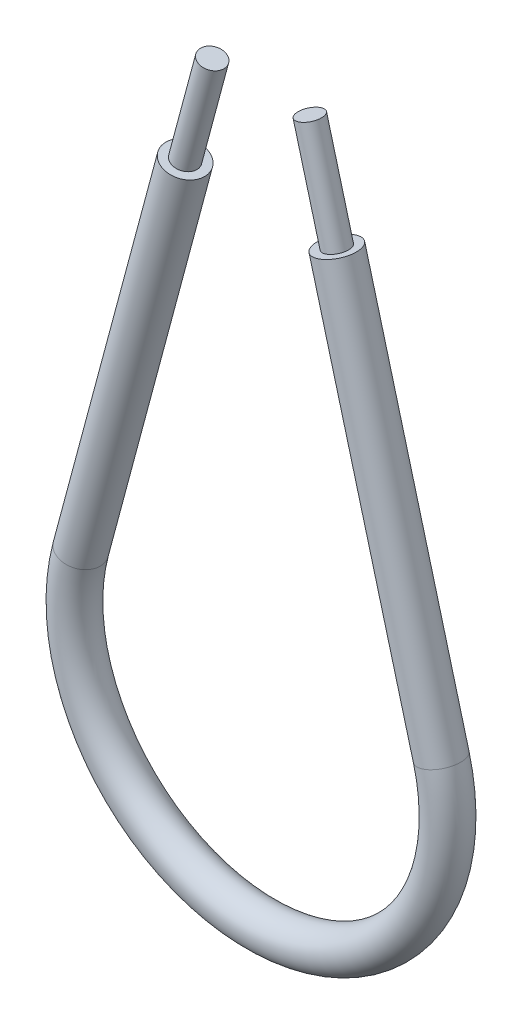
ISO-10303-21;
HEADER;
FILE_DESCRIPTION(('STEP AP214'),'2;1');
FILE_NAME('part.step','',(''),(''),'','','');
FILE_SCHEMA(('AUTOMOTIVE_DESIGN { 1 0 10303 214 1 1 1 1 }'));
ENDSEC;
DATA;
#1=APPLICATION_CONTEXT('core data for automotive mechanical design processes');
#2=APPLICATION_PROTOCOL_DEFINITION('international standard','automotive_design',2000,#1);
#3=PRODUCT_CONTEXT('',#1,'mechanical');
#4=PRODUCT('Part','Part','',(#3));
#5=PRODUCT_RELATED_PRODUCT_CATEGORY('part','',(#4));
#6=PRODUCT_DEFINITION_FORMATION('','',#4);
#7=PRODUCT_DEFINITION_CONTEXT('part definition',#1,'design');
#8=PRODUCT_DEFINITION('design','',#6,#7);
#9=PRODUCT_DEFINITION_SHAPE('','',#8);
#10=(LENGTH_UNIT() NAMED_UNIT(*) SI_UNIT(.MILLI.,.METRE.));
#11=(NAMED_UNIT(*) PLANE_ANGLE_UNIT() SI_UNIT($,.RADIAN.));
#12=(NAMED_UNIT(*) SI_UNIT($,.STERADIAN.) SOLID_ANGLE_UNIT());
#13=UNCERTAINTY_MEASURE_WITH_UNIT(LENGTH_MEASURE(1.E-05),#10,'distance_accuracy_value','');
#14=(GEOMETRIC_REPRESENTATION_CONTEXT(3) GLOBAL_UNCERTAINTY_ASSIGNED_CONTEXT((#13)) GLOBAL_UNIT_ASSIGNED_CONTEXT((#10,
#11,#12)) REPRESENTATION_CONTEXT('',''));
#15=CARTESIAN_POINT('',(0.,0.,0.));
#16=DIRECTION('',(0.,0.,1.));
#17=DIRECTION('',(1.,0.,0.));
#18=AXIS2_PLACEMENT_3D('',#15,#16,#17);
#19=CARTESIAN_POINT('',(-138.985158779205,-15.4299175134411,-2.4980018054066E-13));
#20=DIRECTION('',(-0.258819045102517,-0.965925826289075,0.));
#21=DIRECTION('',(0.965925826289063,-0.258819045102519,0.));
#22=AXIS2_PLACEMENT_3D('',#19,#20,#21);
#23=CYLINDRICAL_SURFACE('',#22,3.96875000000001);
#24=CARTESIAN_POINT('',(-159.61895517711,-92.4362940234599,0.));
#25=DIRECTION('',(0.258819045102516,0.965925826289075,0.));
#26=DIRECTION('',(-0.965925826289063,0.258819045102517,0.));
#27=AXIS2_PLACEMENT_3D('',#24,#25,#26);
#28=CIRCLE('',#27,3.96875000000001);
#29=CARTESIAN_POINT('',(-163.452473300195,-91.4091059382091,0.));
#30=VERTEX_POINT('',#29);
#31=EDGE_CURVE('E136',#30,#30,#28,.T.);
#32=ORIENTED_EDGE('',*,*,#31,.T.);
#33=EDGE_LOOP('',(#32));
#34=FACE_BOUND('',#33,.T.);
#35=CARTESIAN_POINT('',(-138.985158779205,-15.4299175134411,-2.4980018054066E-13));
#36=DIRECTION('',(0.258819045102516,0.965925826289075,0.));
#37=DIRECTION('',(-0.965925826289063,0.258819045102517,0.));
#38=AXIS2_PLACEMENT_3D('',#35,#36,#37);
#39=CIRCLE('',#38,3.96875000000001);
#40=CARTESIAN_POINT('',(-142.818676902289,-14.4027294281905,-1.2490009027033E-12));
#41=VERTEX_POINT('',#40);
#42=EDGE_CURVE('E81',#41,#41,#39,.T.);
#43=ORIENTED_EDGE('',*,*,#42,.F.);
#44=EDGE_LOOP('',(#43));
#45=FACE_BOUND('',#44,.T.);
#46=ADVANCED_FACE('F62',(#34,#45),#23,.T.);
#47=CARTESIAN_POINT('',(-124.004465969192,-101.979167645568,-1.22124532708767E-12));
#48=DIRECTION('',(0.,0.,1.));
#49=DIRECTION('',(1.,0.,0.));
#50=AXIS2_PLACEMENT_3D('',#47,#48,#49);
#51=TOROIDAL_SURFACE('',#50,36.8708323544294,3.96875000000001);
#52=CARTESIAN_POINT('',(-88.3899767612737,-92.4362940234591,-3.33066907387547E-13));
#53=DIRECTION('',(0.258819045102515,-0.96592582628907,0.));
#54=DIRECTION('',(0.965925826289076,0.258819045102515,0.));
#55=AXIS2_PLACEMENT_3D('',#52,#53,#54);
#56=CIRCLE('',#55,3.96875000000001);
#57=CARTESIAN_POINT('',(-84.5564586381897,-91.4091059382086,-2.37464018109115E-13));
#58=VERTEX_POINT('',#57);
#59=EDGE_CURVE('E66',#58,#58,#56,.T.);
#60=CARTESIAN_POINT('',(-124.004465969192,-101.979167645568,-1.22124532708767E-12));
#61=DIRECTION('',(0.,0.,1.));
#62=DIRECTION('',(1.,0.,0.));
#63=AXIS2_PLACEMENT_3D('',#60,#61,#62);
#64=CIRCLE('',#63,40.8395823544294);
#65=EDGE_CURVE('',#30,#58,#64,.T.);
#66=ORIENTED_EDGE('',*,*,#31,.F.);
#67=ORIENTED_EDGE('',*,*,#59,.T.);
#68=ORIENTED_EDGE('',*,*,#65,.T.);
#69=ORIENTED_EDGE('',*,*,#65,.F.);
#70=EDGE_LOOP('',(#66,#68,#67,#69));
#71=FACE_BOUND('',#70,.T.);
#72=ADVANCED_FACE('F143',(#71),#51,.T.);
#73=CARTESIAN_POINT('',(-88.3899767612737,-92.4362940234591,-3.33066907387547E-13));
#74=DIRECTION('',(-0.258819045102514,0.965925826289069,0.));
#75=DIRECTION('',(-0.965925826289076,-0.258819045102514,0.));
#76=AXIS2_PLACEMENT_3D('',#73,#74,#75);
#77=CYLINDRICAL_SURFACE('',#76,3.96875000000001);
#78=CARTESIAN_POINT('',(-109.02377315918,-15.4299175134413,-1.22124532708767E-12));
#79=DIRECTION('',(0.258819045102515,-0.96592582628907,0.));
#80=DIRECTION('',(0.965925826289076,0.258819045102515,0.));
#81=AXIS2_PLACEMENT_3D('',#78,#79,#80);
#82=CIRCLE('',#81,3.96875000000001);
#83=CARTESIAN_POINT('',(-105.190255036096,-14.4027294281898,-1.02695629777827E-12));
#84=VERTEX_POINT('',#83);
#85=EDGE_CURVE('E86',#84,#84,#82,.T.);
#86=ORIENTED_EDGE('',*,*,#85,.T.);
#87=EDGE_LOOP('',(#86));
#88=FACE_BOUND('',#87,.T.);
#89=ORIENTED_EDGE('',*,*,#59,.F.);
#90=EDGE_LOOP('',(#89));
#91=FACE_BOUND('',#90,.T.);
#92=ADVANCED_FACE('F64',(#88,#91),#77,.T.);
#93=CARTESIAN_POINT('',(-138.985158779205,-15.4299175134411,-2.4980018054066E-13));
#94=DIRECTION('',(0.258819045102516,0.965925826289075,0.));
#95=DIRECTION('',(-0.965925826289063,0.258819045102517,0.));
#96=AXIS2_PLACEMENT_3D('',#93,#94,#95);
#97=PLANE('',#96);
#98=CARTESIAN_POINT('',(-138.985158779205,-15.4299175134411,-2.4980018054066E-13));
#99=DIRECTION('',(0.258819045102516,0.965925826289075,0.));
#100=DIRECTION('',(-0.965925826289063,0.258819045102517,0.));
#101=AXIS2_PLACEMENT_3D('',#98,#99,#100);
#102=CIRCLE('',#101,2.38125);
#103=CARTESIAN_POINT('',(-141.285269653055,-14.8136046622911,-1.19348975147204E-12));
#104=VERTEX_POINT('',#103);
#105=EDGE_CURVE('E126',#104,#104,#102,.F.);
#106=ORIENTED_EDGE('',*,*,#105,.T.);
#107=EDGE_LOOP('',(#106));
#108=FACE_BOUND('',#107,.T.);
#109=ORIENTED_EDGE('',*,*,#42,.T.);
#110=EDGE_LOOP('',(#109));
#111=FACE_BOUND('',#110,.T.);
#112=ADVANCED_FACE('F100',(#108,#111),#97,.T.);
#113=CARTESIAN_POINT('',(-109.02377315918,-15.4299175134413,-1.22124532708767E-12));
#114=DIRECTION('',(0.258819045102515,-0.96592582628907,0.));
#115=DIRECTION('',(0.965925826289076,0.258819045102515,0.));
#116=AXIS2_PLACEMENT_3D('',#113,#114,#115);
#117=PLANE('',#116);
#118=CARTESIAN_POINT('',(-109.02377315918,-15.4299175134413,-1.22124532708767E-12));
#119=DIRECTION('',(0.258819045102515,-0.96592582628907,0.));
#120=DIRECTION('',(0.965925826289076,0.258819045102515,0.));
#121=AXIS2_PLACEMENT_3D('',#118,#119,#120);
#122=CIRCLE('',#121,2.38125);
#123=CARTESIAN_POINT('',(-106.723662285329,-14.8136046622901,-1.0547118733939E-12));
#124=VERTEX_POINT('',#123);
#125=EDGE_CURVE('E14',#124,#124,#122,.F.);
#126=ORIENTED_EDGE('',*,*,#125,.F.);
#127=EDGE_LOOP('',(#126));
#128=FACE_BOUND('',#127,.T.);
#129=ORIENTED_EDGE('',*,*,#85,.F.);
#130=EDGE_LOOP('',(#129));
#131=FACE_BOUND('',#130,.T.);
#132=ADVANCED_FACE('F97',(#128,#131),#117,.F.);
#133=CARTESIAN_POINT('',(-138.985158779205,-15.4299175134411,-2.4980018054066E-13));
#134=DIRECTION('',(-0.258819045102517,-0.965925826289075,0.));
#135=DIRECTION('',(0.965925826289063,-0.258819045102519,0.));
#136=AXIS2_PLACEMENT_3D('',#133,#134,#135);
#137=CYLINDRICAL_SURFACE('',#136,2.38125);
#138=CARTESIAN_POINT('',(-159.61895517711,-92.4362940234599,0.));
#139=DIRECTION('',(0.258819045102516,0.965925826289075,0.));
#140=DIRECTION('',(-0.965925826289063,0.258819045102517,0.));
#141=AXIS2_PLACEMENT_3D('',#138,#139,#140);
#142=CIRCLE('',#141,2.38125);
#143=CARTESIAN_POINT('',(-161.919066050961,-91.8199811723094,0.));
#144=VERTEX_POINT('',#143);
#145=EDGE_CURVE('E125',#144,#144,#142,.F.);
#146=ORIENTED_EDGE('',*,*,#145,.T.);
#147=EDGE_LOOP('',(#146));
#148=FACE_BOUND('',#147,.T.);
#149=ORIENTED_EDGE('',*,*,#105,.F.);
#150=EDGE_LOOP('',(#149));
#151=FACE_BOUND('',#150,.T.);
#152=ADVANCED_FACE('F99',(#148,#151),#137,.F.);
#153=CARTESIAN_POINT('',(-124.004465969192,-101.979167645568,-1.22124532708767E-12));
#154=DIRECTION('',(0.,0.,1.));
#155=DIRECTION('',(1.,0.,0.));
#156=AXIS2_PLACEMENT_3D('',#153,#154,#155);
#157=TOROIDAL_SURFACE('',#156,36.8708323544294,2.38125);
#158=CARTESIAN_POINT('',(-88.3899767612737,-92.4362940234591,-3.33066907387547E-13));
#159=DIRECTION('',(0.258819045102515,-0.96592582628907,0.));
#160=DIRECTION('',(0.965925826289076,0.258819045102515,0.));
#161=AXIS2_PLACEMENT_3D('',#158,#159,#160);
#162=CIRCLE('',#161,2.38125);
#163=CARTESIAN_POINT('',(-86.0898658874236,-91.8199811723089,-2.75705173820495E-13));
#164=VERTEX_POINT('',#163);
#165=EDGE_CURVE('E72',#164,#164,#162,.F.);
#166=CARTESIAN_POINT('',(-124.004465969192,-101.979167645568,-1.22124532708767E-12));
#167=DIRECTION('',(0.,0.,1.));
#168=DIRECTION('',(1.,0.,0.));
#169=AXIS2_PLACEMENT_3D('',#166,#167,#168);
#170=CIRCLE('',#169,39.2520823544294);
#171=EDGE_CURVE('',#144,#164,#170,.T.);
#172=ORIENTED_EDGE('',*,*,#145,.F.);
#173=ORIENTED_EDGE('',*,*,#165,.T.);
#174=ORIENTED_EDGE('',*,*,#171,.T.);
#175=ORIENTED_EDGE('',*,*,#171,.F.);
#176=EDGE_LOOP('',(#172,#174,#173,#175));
#177=FACE_BOUND('',#176,.T.);
#178=ADVANCED_FACE('F106',(#177),#157,.F.);
#179=CARTESIAN_POINT('',(-88.3899767612737,-92.4362940234591,-3.33066907387547E-13));
#180=DIRECTION('',(-0.258819045102514,0.965925826289069,0.));
#181=DIRECTION('',(-0.965925826289076,-0.258819045102514,0.));
#182=AXIS2_PLACEMENT_3D('',#179,#180,#181);
#183=CYLINDRICAL_SURFACE('',#182,2.38125);
#184=ORIENTED_EDGE('',*,*,#125,.T.);
#185=EDGE_LOOP('',(#184));
#186=FACE_BOUND('',#185,.T.);
#187=ORIENTED_EDGE('',*,*,#165,.F.);
#188=EDGE_LOOP('',(#187));
#189=FACE_BOUND('',#188,.T.);
#190=ADVANCED_FACE('F94',(#186,#189),#183,.F.);
#191=CLOSED_SHELL('',(#46,#72,#92,#112,#132,#152,#178,#190));
#192=MANIFOLD_SOLID_BREP('B2',#191);
#193=CARTESIAN_POINT('',(-114.365151202483,4.50437672659953,0.));
#194=DIRECTION('',(0.258819045102515,-0.96592582628907,0.));
#195=DIRECTION('',(0.965925826289075,0.258819045102515,0.));
#196=AXIS2_PLACEMENT_3D('',#193,#194,#195);
#197=PLANE('',#196);
#198=CARTESIAN_POINT('',(-114.365151202483,4.50437672659953,0.));
#199=DIRECTION('',(0.258819045102515,-0.96592582628907,0.));
#200=DIRECTION('',(0.965925826289075,0.258819045102515,0.));
#201=AXIS2_PLACEMENT_3D('',#198,#199,#200);
#202=CIRCLE('',#201,2.38125);
#203=CARTESIAN_POINT('',(-112.065040328633,5.12068957774967,-1.2490009027033E-12));
#204=VERTEX_POINT('',#203);
#205=EDGE_CURVE('E202',#204,#204,#202,.T.);
#206=ORIENTED_EDGE('',*,*,#205,.F.);
#207=EDGE_LOOP('',(#206));
#208=FACE_BOUND('',#207,.T.);
#209=ADVANCED_FACE('F187',(#208),#197,.F.);
#210=CARTESIAN_POINT('',(-133.643780735901,4.50437672660017,-5.82867087928207E-13));
#211=DIRECTION('',(0.258819045102514,0.965925826289076,0.));
#212=DIRECTION('',(-0.965925826289064,0.258819045102513,0.));
#213=AXIS2_PLACEMENT_3D('',#210,#211,#212);
#214=PLANE('',#213);
#215=CARTESIAN_POINT('',(-133.643780735901,4.50437672660017,-5.82867087928207E-13));
#216=DIRECTION('',(0.258819045102514,0.965925826289076,0.));
#217=DIRECTION('',(-0.965925826289064,0.258819045102513,0.));
#218=AXIS2_PLACEMENT_3D('',#215,#216,#217);
#219=CIRCLE('',#218,2.38125);
#220=CARTESIAN_POINT('',(-135.943891609752,5.12068957774947,-9.99200722162641E-13));
#221=VERTEX_POINT('',#220);
#222=EDGE_CURVE('E60',#221,#221,#219,.T.);
#223=ORIENTED_EDGE('',*,*,#222,.T.);
#224=EDGE_LOOP('',(#223));
#225=FACE_BOUND('',#224,.T.);
#226=ADVANCED_FACE('F205',(#225),#214,.T.);
#227=CARTESIAN_POINT('',(-114.365151202483,4.50437672659953,0.));
#228=DIRECTION('',(0.258819045102514,-0.965925826289069,0.));
#229=DIRECTION('',(0.965925826289076,0.258819045102514,0.));
#230=AXIS2_PLACEMENT_3D('',#227,#228,#229);
#231=CYLINDRICAL_SURFACE('',#230,2.38125);
#232=CARTESIAN_POINT('',(-88.3899767612737,-92.436294023459,-5.55111512312578E-13));
#233=DIRECTION('',(0.258819045102515,-0.96592582628907,0.));
#234=DIRECTION('',(0.965925826289075,0.258819045102515,0.));
#235=AXIS2_PLACEMENT_3D('',#232,#233,#234);
#236=CIRCLE('',#235,2.38125);
#237=CARTESIAN_POINT('',(-86.0898658874237,-91.8199811723088,-5.13882766311262E-13));
#238=VERTEX_POINT('',#237);
#239=EDGE_CURVE('E215',#238,#238,#236,.T.);
#240=ORIENTED_EDGE('',*,*,#239,.F.);
#241=EDGE_LOOP('',(#240));
#242=FACE_BOUND('',#241,.T.);
#243=ORIENTED_EDGE('',*,*,#205,.T.);
#244=EDGE_LOOP('',(#243));
#245=FACE_BOUND('',#244,.T.);
#246=ADVANCED_FACE('F221',(#242,#245),#231,.T.);
#247=CARTESIAN_POINT('',(-124.004465969192,-101.979167645568,-1.19348975147204E-12));
#248=DIRECTION('',(0.,0.,-1.));
#249=DIRECTION('',(-1.,0.,0.));
#250=AXIS2_PLACEMENT_3D('',#247,#248,#249);
#251=TOROIDAL_SURFACE('',#250,36.8708323544294,2.38125);
#252=CARTESIAN_POINT('',(-159.61895517711,-92.4362940234597,-1.11022302462516E-13));
#253=DIRECTION('',(0.258819045102515,0.965925826289076,0.));
#254=DIRECTION('',(-0.965925826289065,0.258819045102515,0.));
#255=AXIS2_PLACEMENT_3D('',#252,#253,#254);
#256=CIRCLE('',#255,2.38125);
#257=CARTESIAN_POINT('',(-161.919066050961,-91.8199811723092,0.));
#258=VERTEX_POINT('',#257);
#259=EDGE_CURVE('E195',#258,#258,#256,.T.);
#260=CARTESIAN_POINT('',(-124.004465969192,-101.979167645568,-1.19348975147204E-12));
#261=DIRECTION('',(0.,0.,-1.));
#262=DIRECTION('',(-1.,0.,0.));
#263=AXIS2_PLACEMENT_3D('',#260,#261,#262);
#264=CIRCLE('',#263,39.2520823544294);
#265=EDGE_CURVE('',#238,#258,#264,.T.);
#266=ORIENTED_EDGE('',*,*,#239,.T.);
#267=ORIENTED_EDGE('',*,*,#259,.F.);
#268=ORIENTED_EDGE('',*,*,#265,.T.);
#269=ORIENTED_EDGE('',*,*,#265,.F.);
#270=EDGE_LOOP('',(#266,#268,#267,#269));
#271=FACE_BOUND('',#270,.T.);
#272=ADVANCED_FACE('F210',(#271),#251,.T.);
#273=CARTESIAN_POINT('',(-159.61895517711,-92.4362940234601,0.));
#274=DIRECTION('',(0.258819045102514,0.965925826289076,0.));
#275=DIRECTION('',(-0.965925826289064,0.258819045102514,0.));
#276=AXIS2_PLACEMENT_3D('',#273,#274,#275);
#277=CYLINDRICAL_SURFACE('',#276,2.38125);
#278=ORIENTED_EDGE('',*,*,#222,.F.);
#279=EDGE_LOOP('',(#278));
#280=FACE_BOUND('',#279,.T.);
#281=ORIENTED_EDGE('',*,*,#259,.T.);
#282=EDGE_LOOP('',(#281));
#283=FACE_BOUND('',#282,.T.);
#284=ADVANCED_FACE('F207',(#280,#283),#277,.T.);
#285=CLOSED_SHELL('',(#209,#226,#246,#272,#284));
#286=MANIFOLD_SOLID_BREP('B8',#285);
#287=ADVANCED_BREP_SHAPE_REPRESENTATION('',(#18,#192,#286),#14);
#288=SHAPE_DEFINITION_REPRESENTATION(#9,#287);
ENDSEC;
END-ISO-10303-21;
